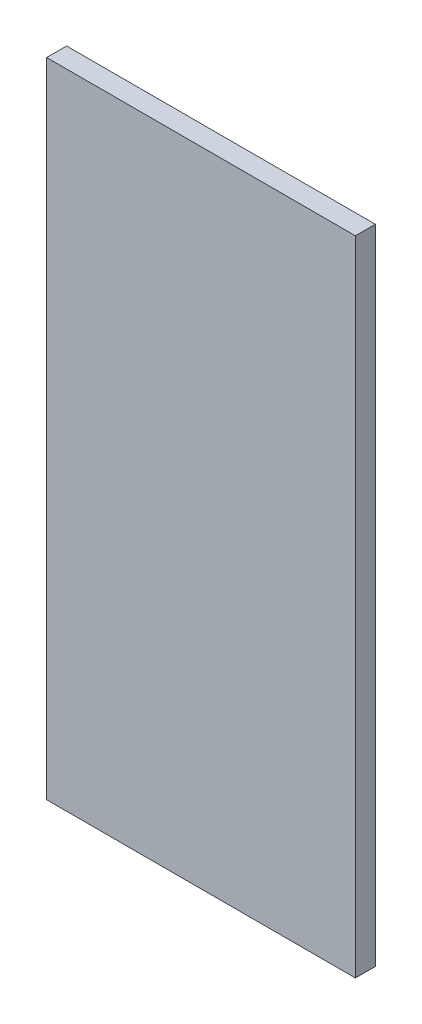
ISO-10303-21;
HEADER;
FILE_DESCRIPTION(('STEP AP214'),'2;1');
FILE_NAME('part.step','',(''),(''),'','','');
FILE_SCHEMA(('AUTOMOTIVE_DESIGN { 1 0 10303 214 1 1 1 1 }'));
ENDSEC;
DATA;
#1=APPLICATION_CONTEXT('core data for automotive mechanical design processes');
#2=APPLICATION_PROTOCOL_DEFINITION('international standard','automotive_design',2000,#1);
#3=PRODUCT_CONTEXT('',#1,'mechanical');
#4=PRODUCT('Part','Part','',(#3));
#5=PRODUCT_RELATED_PRODUCT_CATEGORY('part','',(#4));
#6=PRODUCT_DEFINITION_FORMATION('','',#4);
#7=PRODUCT_DEFINITION_CONTEXT('part definition',#1,'design');
#8=PRODUCT_DEFINITION('design','',#6,#7);
#9=PRODUCT_DEFINITION_SHAPE('','',#8);
#10=(LENGTH_UNIT() NAMED_UNIT(*) SI_UNIT(.MILLI.,.METRE.));
#11=(NAMED_UNIT(*) PLANE_ANGLE_UNIT() SI_UNIT($,.RADIAN.));
#12=(NAMED_UNIT(*) SI_UNIT($,.STERADIAN.) SOLID_ANGLE_UNIT());
#13=UNCERTAINTY_MEASURE_WITH_UNIT(LENGTH_MEASURE(1.E-05),#10,'distance_accuracy_value','');
#14=(GEOMETRIC_REPRESENTATION_CONTEXT(3) GLOBAL_UNCERTAINTY_ASSIGNED_CONTEXT((#13)) GLOBAL_UNIT_ASSIGNED_CONTEXT((#10,
#11,#12)) REPRESENTATION_CONTEXT('',''));
#15=CARTESIAN_POINT('',(0.,0.,0.));
#16=DIRECTION('',(0.,0.,1.));
#17=DIRECTION('',(1.,0.,0.));
#18=AXIS2_PLACEMENT_3D('',#15,#16,#17);
#19=CARTESIAN_POINT('',(89.4420013427734,102.857002258301,0.));
#20=DIRECTION('',(1.,0.,0.));
#21=DIRECTION('',(0.,-1.,0.));
#22=AXIS2_PLACEMENT_3D('',#19,#20,#21);
#23=PLANE('',#22);
#24=DIRECTION('',(0.,-1.,0.));
#25=VECTOR('',#24,1.);
#26=CARTESIAN_POINT('',(89.4420013427734,102.857002258301,0.03556));
#27=LINE('',#26,#25);
#28=CARTESIAN_POINT('',(89.4420013427734,102.857002258301,0.03556));
#29=VERTEX_POINT('',#28);
#30=CARTESIAN_POINT('',(89.4420013427734,101.71199798584,0.03556));
#31=VERTEX_POINT('',#30);
#32=EDGE_CURVE('E11',#29,#31,#27,.T.);
#33=ORIENTED_EDGE('',*,*,#32,.F.);
#34=DIRECTION('',(0.,0.,1.));
#35=VECTOR('',#34,1.);
#36=CARTESIAN_POINT('',(89.4420013427734,102.857002258301,0.));
#37=LINE('',#36,#35);
#38=CARTESIAN_POINT('',(89.4420013427734,102.857002258301,0.));
#39=VERTEX_POINT('',#38);
#40=EDGE_CURVE('E24',#39,#29,#37,.T.);
#41=ORIENTED_EDGE('',*,*,#40,.F.);
#42=DIRECTION('',(0.,-1.,0.));
#43=VECTOR('',#42,1.);
#44=CARTESIAN_POINT('',(89.4420013427734,102.857002258301,0.));
#45=LINE('',#44,#43);
#46=CARTESIAN_POINT('',(89.4420013427734,101.71199798584,0.));
#47=VERTEX_POINT('',#46);
#48=EDGE_CURVE('E75',#39,#47,#45,.T.);
#49=ORIENTED_EDGE('',*,*,#48,.T.);
#50=DIRECTION('',(0.,0.,1.));
#51=VECTOR('',#50,1.);
#52=CARTESIAN_POINT('',(89.4420013427734,101.71199798584,0.));
#53=LINE('',#52,#51);
#54=EDGE_CURVE('E37',#47,#31,#53,.T.);
#55=ORIENTED_EDGE('',*,*,#54,.T.);
#56=EDGE_LOOP('',(#33,#41,#49,#55));
#57=FACE_BOUND('',#56,.T.);
#58=ADVANCED_FACE('F17',(#57),#23,.F.);
#59=CARTESIAN_POINT('',(89.4420013427734,101.71199798584,0.));
#60=DIRECTION('',(0.,1.,0.));
#61=DIRECTION('',(1.,0.,0.));
#62=AXIS2_PLACEMENT_3D('',#59,#60,#61);
#63=PLANE('',#62);
#64=DIRECTION('',(1.,0.,0.));
#65=VECTOR('',#64,1.);
#66=CARTESIAN_POINT('',(89.4420013427734,101.71199798584,0.03556));
#67=LINE('',#66,#65);
#68=CARTESIAN_POINT('',(89.9919967651367,101.71199798584,0.03556));
#69=VERTEX_POINT('',#68);
#70=EDGE_CURVE('E83',#31,#69,#67,.T.);
#71=ORIENTED_EDGE('',*,*,#70,.F.);
#72=ORIENTED_EDGE('',*,*,#54,.F.);
#73=DIRECTION('',(1.,0.,0.));
#74=VECTOR('',#73,1.);
#75=CARTESIAN_POINT('',(89.4420013427734,101.71199798584,0.));
#76=LINE('',#75,#74);
#77=CARTESIAN_POINT('',(89.9919967651367,101.71199798584,0.));
#78=VERTEX_POINT('',#77);
#79=EDGE_CURVE('E81',#47,#78,#76,.T.);
#80=ORIENTED_EDGE('',*,*,#79,.T.);
#81=DIRECTION('',(0.,0.,1.));
#82=VECTOR('',#81,1.);
#83=CARTESIAN_POINT('',(89.9919967651367,101.71199798584,0.));
#84=LINE('',#83,#82);
#85=EDGE_CURVE('E67',#78,#69,#84,.T.);
#86=ORIENTED_EDGE('',*,*,#85,.T.);
#87=EDGE_LOOP('',(#71,#72,#80,#86));
#88=FACE_BOUND('',#87,.T.);
#89=ADVANCED_FACE('F89',(#88),#63,.F.);
#90=CARTESIAN_POINT('',(89.9919967651367,101.71199798584,0.));
#91=DIRECTION('',(-1.,0.,0.));
#92=DIRECTION('',(0.,1.,0.));
#93=AXIS2_PLACEMENT_3D('',#90,#91,#92);
#94=PLANE('',#93);
#95=DIRECTION('',(0.,1.,0.));
#96=VECTOR('',#95,1.);
#97=CARTESIAN_POINT('',(89.9919967651367,101.71199798584,0.03556));
#98=LINE('',#97,#96);
#99=CARTESIAN_POINT('',(89.9919967651367,102.857002258301,0.03556));
#100=VERTEX_POINT('',#99);
#101=EDGE_CURVE('E71',#69,#100,#98,.T.);
#102=ORIENTED_EDGE('',*,*,#101,.F.);
#103=ORIENTED_EDGE('',*,*,#85,.F.);
#104=DIRECTION('',(0.,1.,0.));
#105=VECTOR('',#104,1.);
#106=CARTESIAN_POINT('',(89.9919967651367,101.71199798584,0.));
#107=LINE('',#106,#105);
#108=CARTESIAN_POINT('',(89.9919967651367,102.857002258301,0.));
#109=VERTEX_POINT('',#108);
#110=EDGE_CURVE('E63',#78,#109,#107,.T.);
#111=ORIENTED_EDGE('',*,*,#110,.T.);
#112=DIRECTION('',(0.,0.,1.));
#113=VECTOR('',#112,1.);
#114=CARTESIAN_POINT('',(89.9919967651367,102.857002258301,0.));
#115=LINE('',#114,#113);
#116=EDGE_CURVE('E53',#109,#100,#115,.T.);
#117=ORIENTED_EDGE('',*,*,#116,.T.);
#118=EDGE_LOOP('',(#102,#103,#111,#117));
#119=FACE_BOUND('',#118,.T.);
#120=ADVANCED_FACE('F66',(#119),#94,.F.);
#121=CARTESIAN_POINT('',(89.9919967651367,102.857002258301,0.));
#122=DIRECTION('',(0.,-1.,0.));
#123=DIRECTION('',(-1.,0.,0.));
#124=AXIS2_PLACEMENT_3D('',#121,#122,#123);
#125=PLANE('',#124);
#126=DIRECTION('',(-1.,0.,0.));
#127=VECTOR('',#126,1.);
#128=CARTESIAN_POINT('',(89.9919967651367,102.857002258301,0.03556));
#129=LINE('',#128,#127);
#130=EDGE_CURVE('E59',#100,#29,#129,.T.);
#131=ORIENTED_EDGE('',*,*,#130,.F.);
#132=ORIENTED_EDGE('',*,*,#116,.F.);
#133=DIRECTION('',(-1.,0.,0.));
#134=VECTOR('',#133,1.);
#135=CARTESIAN_POINT('',(89.9919967651367,102.857002258301,0.));
#136=LINE('',#135,#134);
#137=EDGE_CURVE('E57',#109,#39,#136,.T.);
#138=ORIENTED_EDGE('',*,*,#137,.T.);
#139=ORIENTED_EDGE('',*,*,#40,.T.);
#140=EDGE_LOOP('',(#131,#132,#138,#139));
#141=FACE_BOUND('',#140,.T.);
#142=ADVANCED_FACE('F55',(#141),#125,.F.);
#143=CARTESIAN_POINT('',(89.4420013427734,102.857002258301,0.));
#144=DIRECTION('',(0.,0.,-1.));
#145=DIRECTION('',(-1.,0.,0.));
#146=AXIS2_PLACEMENT_3D('',#143,#144,#145);
#147=PLANE('',#146);
#148=ORIENTED_EDGE('',*,*,#137,.F.);
#149=ORIENTED_EDGE('',*,*,#110,.F.);
#150=ORIENTED_EDGE('',*,*,#79,.F.);
#151=ORIENTED_EDGE('',*,*,#48,.F.);
#152=EDGE_LOOP('',(#148,#149,#150,#151));
#153=FACE_BOUND('',#152,.T.);
#154=ADVANCED_FACE('F74',(#153),#147,.T.);
#155=CARTESIAN_POINT('',(89.4420013427734,102.857002258301,0.03556));
#156=DIRECTION('',(0.,0.,-1.));
#157=DIRECTION('',(-1.,0.,0.));
#158=AXIS2_PLACEMENT_3D('',#155,#156,#157);
#159=PLANE('',#158);
#160=ORIENTED_EDGE('',*,*,#32,.T.);
#161=ORIENTED_EDGE('',*,*,#70,.T.);
#162=ORIENTED_EDGE('',*,*,#101,.T.);
#163=ORIENTED_EDGE('',*,*,#130,.T.);
#164=EDGE_LOOP('',(#160,#161,#162,#163));
#165=FACE_BOUND('',#164,.T.);
#166=ADVANCED_FACE('F91',(#165),#159,.F.);
#167=CLOSED_SHELL('',(#58,#89,#120,#142,#154,#166));
#168=MANIFOLD_SOLID_BREP('B1',#167);
#169=ADVANCED_BREP_SHAPE_REPRESENTATION('',(#18,#168),#14);
#170=SHAPE_DEFINITION_REPRESENTATION(#9,#169);
ENDSEC;
END-ISO-10303-21;
